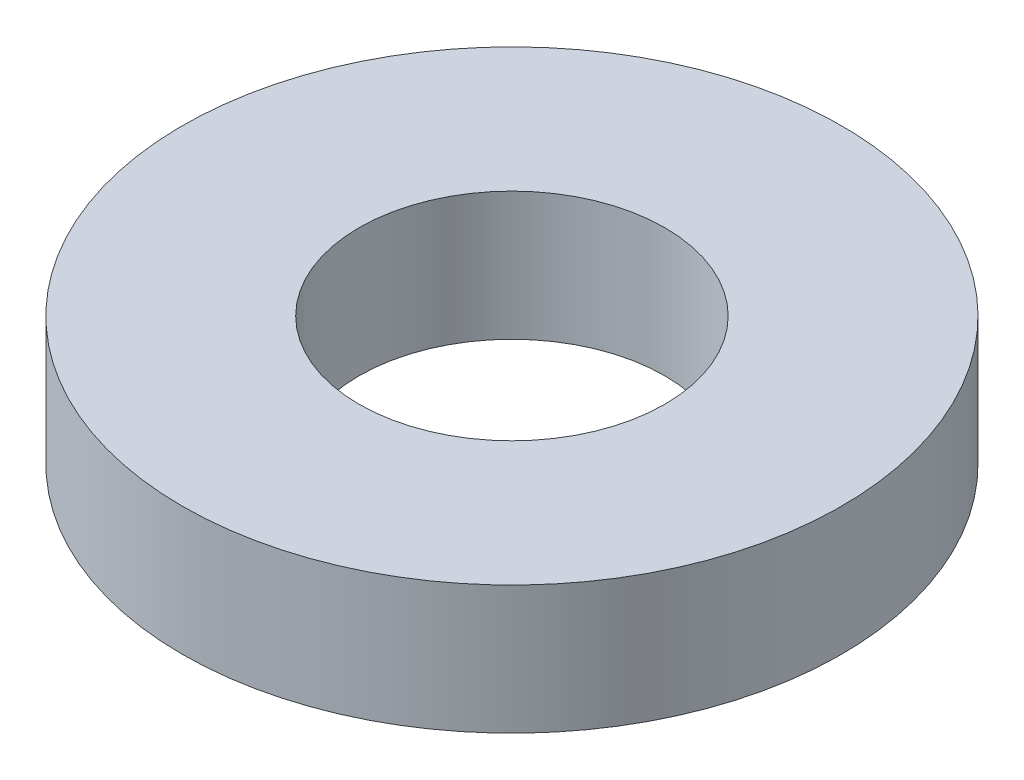
ISO-10303-21;
HEADER;
FILE_DESCRIPTION(('STEP AP214'),'2;1');
FILE_NAME('part.step','',(''),(''),'','','');
FILE_SCHEMA(('AUTOMOTIVE_DESIGN { 1 0 10303 214 1 1 1 1 }'));
ENDSEC;
DATA;
#1=APPLICATION_CONTEXT('core data for automotive mechanical design processes');
#2=APPLICATION_PROTOCOL_DEFINITION('international standard','automotive_design',2000,#1);
#3=PRODUCT_CONTEXT('',#1,'mechanical');
#4=PRODUCT('Part','Part','',(#3));
#5=PRODUCT_RELATED_PRODUCT_CATEGORY('part','',(#4));
#6=PRODUCT_DEFINITION_FORMATION('','',#4);
#7=PRODUCT_DEFINITION_CONTEXT('part definition',#1,'design');
#8=PRODUCT_DEFINITION('design','',#6,#7);
#9=PRODUCT_DEFINITION_SHAPE('','',#8);
#10=(LENGTH_UNIT() NAMED_UNIT(*) SI_UNIT(.MILLI.,.METRE.));
#11=(NAMED_UNIT(*) PLANE_ANGLE_UNIT() SI_UNIT($,.RADIAN.));
#12=(NAMED_UNIT(*) SI_UNIT($,.STERADIAN.) SOLID_ANGLE_UNIT());
#13=UNCERTAINTY_MEASURE_WITH_UNIT(LENGTH_MEASURE(1.E-05),#10,'distance_accuracy_value','');
#14=(GEOMETRIC_REPRESENTATION_CONTEXT(3) GLOBAL_UNCERTAINTY_ASSIGNED_CONTEXT((#13)) GLOBAL_UNIT_ASSIGNED_CONTEXT((#10,
#11,#12)) REPRESENTATION_CONTEXT('',''));
#15=CARTESIAN_POINT('',(0.,0.,0.));
#16=DIRECTION('',(0.,0.,1.));
#17=DIRECTION('',(1.,0.,0.));
#18=AXIS2_PLACEMENT_3D('',#15,#16,#17);
#19=CARTESIAN_POINT('',(0.,1.8542,0.));
#20=DIRECTION('',(0.,-1.,0.));
#21=DIRECTION('',(0.,0.,-1.));
#22=AXIS2_PLACEMENT_3D('',#19,#20,#21);
#23=CYLINDRICAL_SURFACE('',#22,4.7625);
#24=CARTESIAN_POINT('',(0.,1.8542,0.));
#25=DIRECTION('',(0.,1.,0.));
#26=DIRECTION('',(0.,0.,1.));
#27=AXIS2_PLACEMENT_3D('',#24,#25,#26);
#28=CIRCLE('',#27,4.7625);
#29=CARTESIAN_POINT('',(0.,1.8542,4.7625));
#30=VERTEX_POINT('',#29);
#31=EDGE_CURVE('E10',#30,#30,#28,.T.);
#32=ORIENTED_EDGE('',*,*,#31,.F.);
#33=EDGE_LOOP('',(#32));
#34=FACE_BOUND('',#33,.T.);
#35=CARTESIAN_POINT('',(0.,0.,0.));
#36=DIRECTION('',(0.,1.,0.));
#37=DIRECTION('',(0.,0.,1.));
#38=AXIS2_PLACEMENT_3D('',#35,#36,#37);
#39=CIRCLE('',#38,4.7625);
#40=CARTESIAN_POINT('',(0.,0.,4.7625));
#41=VERTEX_POINT('',#40);
#42=EDGE_CURVE('E33',#41,#41,#39,.T.);
#43=ORIENTED_EDGE('',*,*,#42,.T.);
#44=EDGE_LOOP('',(#43));
#45=FACE_BOUND('',#44,.T.);
#46=ADVANCED_FACE('F30',(#34,#45),#23,.T.);
#47=CARTESIAN_POINT('',(0.,1.8542,0.));
#48=DIRECTION('',(0.,1.,0.));
#49=DIRECTION('',(0.,0.,1.));
#50=AXIS2_PLACEMENT_3D('',#47,#48,#49);
#51=PLANE('',#50);
#52=CARTESIAN_POINT('',(0.,1.8542,0.));
#53=DIRECTION('',(0.,1.,0.));
#54=DIRECTION('',(0.,0.,1.));
#55=AXIS2_PLACEMENT_3D('',#52,#53,#54);
#56=CIRCLE('',#55,2.2098);
#57=CARTESIAN_POINT('',(0.,1.8542,2.2098));
#58=VERTEX_POINT('',#57);
#59=EDGE_CURVE('E42',#58,#58,#56,.T.);
#60=ORIENTED_EDGE('',*,*,#59,.F.);
#61=EDGE_LOOP('',(#60));
#62=FACE_BOUND('',#61,.T.);
#63=ORIENTED_EDGE('',*,*,#31,.T.);
#64=EDGE_LOOP('',(#63));
#65=FACE_BOUND('',#64,.T.);
#66=ADVANCED_FACE('F57',(#62,#65),#51,.T.);
#67=CARTESIAN_POINT('',(0.,0.,0.));
#68=DIRECTION('',(0.,1.,0.));
#69=DIRECTION('',(0.,0.,1.));
#70=AXIS2_PLACEMENT_3D('',#67,#68,#69);
#71=PLANE('',#70);
#72=CARTESIAN_POINT('',(0.,0.,0.));
#73=DIRECTION('',(0.,1.,0.));
#74=DIRECTION('',(0.,0.,1.));
#75=AXIS2_PLACEMENT_3D('',#72,#73,#74);
#76=CIRCLE('',#75,2.2098);
#77=CARTESIAN_POINT('',(0.,0.,2.2098));
#78=VERTEX_POINT('',#77);
#79=EDGE_CURVE('E40',#78,#78,#76,.T.);
#80=ORIENTED_EDGE('',*,*,#79,.T.);
#81=EDGE_LOOP('',(#80));
#82=FACE_BOUND('',#81,.T.);
#83=ORIENTED_EDGE('',*,*,#42,.F.);
#84=EDGE_LOOP('',(#83));
#85=FACE_BOUND('',#84,.T.);
#86=ADVANCED_FACE('F48',(#82,#85),#71,.F.);
#87=CARTESIAN_POINT('',(0.,0.,0.));
#88=DIRECTION('',(0.,1.,0.));
#89=DIRECTION('',(0.,0.,1.));
#90=AXIS2_PLACEMENT_3D('',#87,#88,#89);
#91=CYLINDRICAL_SURFACE('',#90,2.2098);
#92=ORIENTED_EDGE('',*,*,#79,.F.);
#93=EDGE_LOOP('',(#92));
#94=FACE_BOUND('',#93,.T.);
#95=ORIENTED_EDGE('',*,*,#59,.T.);
#96=EDGE_LOOP('',(#95));
#97=FACE_BOUND('',#96,.T.);
#98=ADVANCED_FACE('F51',(#94,#97),#91,.F.);
#99=CLOSED_SHELL('',(#46,#66,#86,#98));
#100=MANIFOLD_SOLID_BREP('B2',#99);
#101=ADVANCED_BREP_SHAPE_REPRESENTATION('',(#18,#100),#14);
#102=SHAPE_DEFINITION_REPRESENTATION(#9,#101);
ENDSEC;
END-ISO-10303-21;
